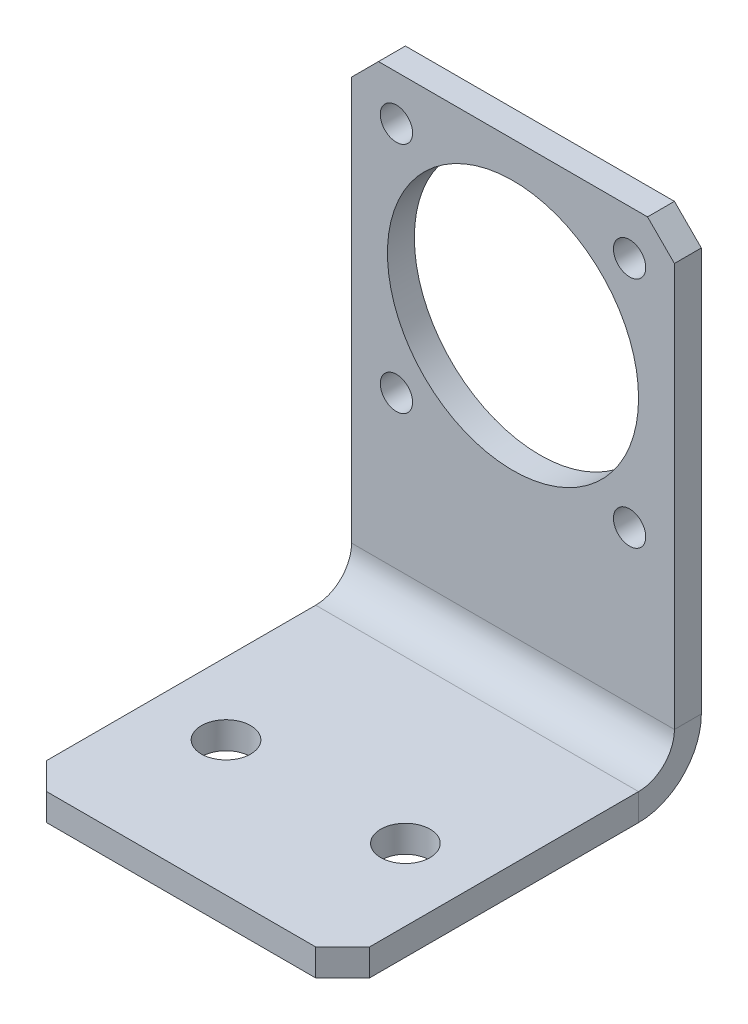
ISO-10303-21;
HEADER;
FILE_DESCRIPTION(('STEP AP214'),'2;1');
FILE_NAME('part.step','',(''),(''),'','','');
FILE_SCHEMA(('AUTOMOTIVE_DESIGN { 1 0 10303 214 1 1 1 1 }'));
ENDSEC;
DATA;
#1=APPLICATION_CONTEXT('core data for automotive mechanical design processes');
#2=APPLICATION_PROTOCOL_DEFINITION('international standard','automotive_design',2000,#1);
#3=PRODUCT_CONTEXT('',#1,'mechanical');
#4=PRODUCT('Part','Part','',(#3));
#5=PRODUCT_RELATED_PRODUCT_CATEGORY('part','',(#4));
#6=PRODUCT_DEFINITION_FORMATION('','',#4);
#7=PRODUCT_DEFINITION_CONTEXT('part definition',#1,'design');
#8=PRODUCT_DEFINITION('design','',#6,#7);
#9=PRODUCT_DEFINITION_SHAPE('','',#8);
#10=(LENGTH_UNIT() NAMED_UNIT(*) SI_UNIT(.MILLI.,.METRE.));
#11=(NAMED_UNIT(*) PLANE_ANGLE_UNIT() SI_UNIT($,.RADIAN.));
#12=(NAMED_UNIT(*) SI_UNIT($,.STERADIAN.) SOLID_ANGLE_UNIT());
#13=UNCERTAINTY_MEASURE_WITH_UNIT(LENGTH_MEASURE(1.E-05),#10,'distance_accuracy_value','');
#14=(GEOMETRIC_REPRESENTATION_CONTEXT(3) GLOBAL_UNCERTAINTY_ASSIGNED_CONTEXT((#13)) GLOBAL_UNIT_ASSIGNED_CONTEXT((#10,
#11,#12)) REPRESENTATION_CONTEXT('',''));
#15=CARTESIAN_POINT('',(0.,0.,0.));
#16=DIRECTION('',(0.,0.,1.));
#17=DIRECTION('',(1.,0.,0.));
#18=AXIS2_PLACEMENT_3D('',#15,#16,#17);
#19=CARTESIAN_POINT('',(0.,7.18062020262805,7.82));
#20=DIRECTION('',(0.,0.,-1.));
#21=DIRECTION('',(0.,1.,0.));
#22=AXIS2_PLACEMENT_3D('',#19,#20,#21);
#23=PLANE('',#22);
#24=CARTESIAN_POINT('',(13.,21.000620202628,7.81999999999997));
#25=DIRECTION('',(0.,0.,1.));
#26=DIRECTION('',(-1.,0.,0.));
#27=AXIS2_PLACEMENT_3D('',#24,#25,#26);
#28=CIRCLE('',#27,1.8);
#29=CARTESIAN_POINT('',(11.2,21.000620202628,7.81999999999997));
#30=VERTEX_POINT('',#29);
#31=EDGE_CURVE('E233',#30,#30,#28,.T.);
#32=ORIENTED_EDGE('',*,*,#31,.F.);
#33=EDGE_LOOP('',(#32));
#34=FACE_BOUND('',#33,.T.);
#35=CARTESIAN_POINT('',(-13.,21.000620202628,7.81999999999997));
#36=DIRECTION('',(0.,0.,1.));
#37=DIRECTION('',(1.,0.,0.));
#38=AXIS2_PLACEMENT_3D('',#35,#36,#37);
#39=CIRCLE('',#38,1.8);
#40=CARTESIAN_POINT('',(-11.2,21.000620202628,7.81999999999997));
#41=VERTEX_POINT('',#40);
#42=EDGE_CURVE('E229',#41,#41,#39,.T.);
#43=ORIENTED_EDGE('',*,*,#42,.F.);
#44=EDGE_LOOP('',(#43));
#45=FACE_BOUND('',#44,.T.);
#46=CARTESIAN_POINT('',(-13.,47.000620202628,7.81999999999997));
#47=DIRECTION('',(0.,0.,1.));
#48=DIRECTION('',(-1.,0.,0.));
#49=AXIS2_PLACEMENT_3D('',#46,#47,#48);
#50=CIRCLE('',#49,1.8);
#51=CARTESIAN_POINT('',(-14.8,47.000620202628,7.81999999999997));
#52=VERTEX_POINT('',#51);
#53=EDGE_CURVE('E225',#52,#52,#50,.T.);
#54=ORIENTED_EDGE('',*,*,#53,.F.);
#55=EDGE_LOOP('',(#54));
#56=FACE_BOUND('',#55,.T.);
#57=CARTESIAN_POINT('',(13.,47.000620202628,7.81999999999997));
#58=DIRECTION('',(0.,0.,1.));
#59=DIRECTION('',(1.,0.,0.));
#60=AXIS2_PLACEMENT_3D('',#57,#58,#59);
#61=CIRCLE('',#60,1.8);
#62=CARTESIAN_POINT('',(14.8,47.000620202628,7.81999999999997));
#63=VERTEX_POINT('',#62);
#64=EDGE_CURVE('E221',#63,#63,#61,.T.);
#65=ORIENTED_EDGE('',*,*,#64,.F.);
#66=EDGE_LOOP('',(#65));
#67=FACE_BOUND('',#66,.T.);
#68=CARTESIAN_POINT('',(0.,34.000620202628,7.81999999999997));
#69=DIRECTION('',(0.,0.,1.));
#70=DIRECTION('',(1.,0.,0.));
#71=AXIS2_PLACEMENT_3D('',#68,#69,#70);
#72=CIRCLE('',#71,14.);
#73=CARTESIAN_POINT('',(14.,34.000620202628,7.81999999999997));
#74=VERTEX_POINT('',#73);
#75=EDGE_CURVE('E217',#74,#74,#72,.T.);
#76=ORIENTED_EDGE('',*,*,#75,.F.);
#77=EDGE_LOOP('',(#76));
#78=FACE_BOUND('',#77,.T.);
#79=DIRECTION('',(0.,1.,0.));
#80=VECTOR('',#79,1.);
#81=CARTESIAN_POINT('',(18.,-37.6393797973719,7.81999999999984));
#82=LINE('',#81,#80);
#83=CARTESIAN_POINT('',(18.,4.00000000000002,7.81999999999999));
#84=VERTEX_POINT('',#83);
#85=CARTESIAN_POINT('',(18.,49.000620202628,7.82000000000014));
#86=VERTEX_POINT('',#85);
#87=EDGE_CURVE('E164',#84,#86,#82,.T.);
#88=ORIENTED_EDGE('',*,*,#87,.T.);
#89=DIRECTION('',(0.70710678118655,-0.707106781186545,0.));
#90=VECTOR('',#89,1.);
#91=CARTESIAN_POINT('',(18.,49.000620202628,7.82000000000014));
#92=LINE('',#91,#90);
#93=CARTESIAN_POINT('',(15.,52.000620202628,7.82000000000015));
#94=VERTEX_POINT('',#93);
#95=EDGE_CURVE('E254',#86,#94,#92,.F.);
#96=ORIENTED_EDGE('',*,*,#95,.T.);
#97=DIRECTION('',(-1.,0.,0.));
#98=VECTOR('',#97,1.);
#99=CARTESIAN_POINT('',(-18.,52.000620202628,7.82000000000015));
#100=LINE('',#99,#98);
#101=CARTESIAN_POINT('',(-15.,52.000620202628,7.82000000000015));
#102=VERTEX_POINT('',#101);
#103=EDGE_CURVE('E193',#94,#102,#100,.T.);
#104=ORIENTED_EDGE('',*,*,#103,.T.);
#105=DIRECTION('',(0.707106781186546,0.707106781186549,0.));
#106=VECTOR('',#105,1.);
#107=CARTESIAN_POINT('',(-15.,52.000620202628,7.82000000000015));
#108=LINE('',#107,#106);
#109=CARTESIAN_POINT('',(-18.,49.000620202628,7.82000000000014));
#110=VERTEX_POINT('',#109);
#111=EDGE_CURVE('E252',#102,#110,#108,.F.);
#112=ORIENTED_EDGE('',*,*,#111,.T.);
#113=DIRECTION('',(0.,-1.,0.));
#114=VECTOR('',#113,1.);
#115=CARTESIAN_POINT('',(-18.,-37.6393797973719,7.81999999999984));
#116=LINE('',#115,#114);
#117=CARTESIAN_POINT('',(-18.,4.00000000000002,7.81999999999999));
#118=VERTEX_POINT('',#117);
#119=EDGE_CURVE('E196',#110,#118,#116,.T.);
#120=ORIENTED_EDGE('',*,*,#119,.T.);
#121=DIRECTION('',(1.,0.,0.));
#122=VECTOR('',#121,1.);
#123=CARTESIAN_POINT('',(0.,4.00000000000003,7.81999999999999));
#124=LINE('',#123,#122);
#125=EDGE_CURVE('E202',#118,#84,#124,.T.);
#126=ORIENTED_EDGE('',*,*,#125,.T.);
#127=EDGE_LOOP('',(#88,#96,#104,#112,#120,#126));
#128=FACE_BOUND('',#127,.T.);
#129=ADVANCED_FACE('F41',(#34,#45,#56,#67,#78,#128),#23,.F.);
#130=CARTESIAN_POINT('',(18.,-37.6393797973719,4.81999999999984));
#131=DIRECTION('',(1.,0.,0.));
#132=DIRECTION('',(0.,1.,0.));
#133=AXIS2_PLACEMENT_3D('',#130,#131,#132);
#134=PLANE('',#133);
#135=DIRECTION('',(0.,1.,0.));
#136=VECTOR('',#135,1.);
#137=CARTESIAN_POINT('',(18.,-37.6393797973719,4.81999999999984));
#138=LINE('',#137,#136);
#139=CARTESIAN_POINT('',(18.,4.00000000000002,4.81999999999997));
#140=VERTEX_POINT('',#139);
#141=CARTESIAN_POINT('',(18.,49.000620202628,4.82000000000014));
#142=VERTEX_POINT('',#141);
#143=EDGE_CURVE('E192',#140,#142,#138,.T.);
#144=ORIENTED_EDGE('',*,*,#143,.T.);
#145=DIRECTION('',(0.,0.,1.));
#146=VECTOR('',#145,1.);
#147=CARTESIAN_POINT('',(18.,49.0006202026281,4.82000000000014));
#148=LINE('',#147,#146);
#149=EDGE_CURVE('E249',#142,#86,#148,.T.);
#150=ORIENTED_EDGE('',*,*,#149,.T.);
#151=ORIENTED_EDGE('',*,*,#87,.F.);
#152=DIRECTION('',(0.,0.,1.));
#153=VECTOR('',#152,1.);
#154=CARTESIAN_POINT('',(18.,4.00000000000004,4.81999999999998));
#155=LINE('',#154,#153);
#156=EDGE_CURVE('E199',#140,#84,#155,.T.);
#157=ORIENTED_EDGE('',*,*,#156,.F.);
#158=EDGE_LOOP('',(#144,#150,#151,#157));
#159=FACE_BOUND('',#158,.T.);
#160=ADVANCED_FACE('F269',(#159),#134,.T.);
#161=CARTESIAN_POINT('',(-18.,-37.6393797973719,4.81999999999984));
#162=DIRECTION('',(-1.,0.,0.));
#163=DIRECTION('',(0.,-1.,0.));
#164=AXIS2_PLACEMENT_3D('',#161,#162,#163);
#165=PLANE('',#164);
#166=ORIENTED_EDGE('',*,*,#119,.F.);
#167=DIRECTION('',(0.,0.,-1.));
#168=VECTOR('',#167,1.);
#169=CARTESIAN_POINT('',(-18.,49.000620202628,4.82000000000014));
#170=LINE('',#169,#168);
#171=CARTESIAN_POINT('',(-18.,49.000620202628,4.82000000000014));
#172=VERTEX_POINT('',#171);
#173=EDGE_CURVE('E12',#110,#172,#170,.T.);
#174=ORIENTED_EDGE('',*,*,#173,.T.);
#175=DIRECTION('',(0.,-1.,0.));
#176=VECTOR('',#175,1.);
#177=CARTESIAN_POINT('',(-18.,-37.6393797973719,4.81999999999984));
#178=LINE('',#177,#176);
#179=CARTESIAN_POINT('',(-18.,4.00000000000002,4.81999999999999));
#180=VERTEX_POINT('',#179);
#181=EDGE_CURVE('E191',#172,#180,#178,.T.);
#182=ORIENTED_EDGE('',*,*,#181,.T.);
#183=DIRECTION('',(0.,0.,-1.));
#184=VECTOR('',#183,1.);
#185=CARTESIAN_POINT('',(-18.,4.00000000000004,4.81999999999998));
#186=LINE('',#185,#184);
#187=EDGE_CURVE('E138',#118,#180,#186,.T.);
#188=ORIENTED_EDGE('',*,*,#187,.F.);
#189=EDGE_LOOP('',(#166,#174,#182,#188));
#190=FACE_BOUND('',#189,.T.);
#191=ADVANCED_FACE('F277',(#190),#165,.T.);
#192=CARTESIAN_POINT('',(-18.,52.0006202026281,4.82000000000015));
#193=DIRECTION('',(0.,1.,0.));
#194=DIRECTION('',(-1.,0.,0.));
#195=AXIS2_PLACEMENT_3D('',#192,#193,#194);
#196=PLANE('',#195);
#197=ORIENTED_EDGE('',*,*,#103,.F.);
#198=DIRECTION('',(0.,0.,-1.));
#199=VECTOR('',#198,1.);
#200=CARTESIAN_POINT('',(15.,52.0006202026281,4.82000000000015));
#201=LINE('',#200,#199);
#202=CARTESIAN_POINT('',(15.,52.0006202026281,4.82000000000015));
#203=VERTEX_POINT('',#202);
#204=EDGE_CURVE('E259',#94,#203,#201,.T.);
#205=ORIENTED_EDGE('',*,*,#204,.T.);
#206=DIRECTION('',(-1.,0.,0.));
#207=VECTOR('',#206,1.);
#208=CARTESIAN_POINT('',(-18.,52.0006202026281,4.82000000000015));
#209=LINE('',#208,#207);
#210=CARTESIAN_POINT('',(-15.,52.0006202026281,4.82000000000015));
#211=VERTEX_POINT('',#210);
#212=EDGE_CURVE('E189',#203,#211,#209,.T.);
#213=ORIENTED_EDGE('',*,*,#212,.T.);
#214=DIRECTION('',(0.,0.,1.));
#215=VECTOR('',#214,1.);
#216=CARTESIAN_POINT('',(-15.,52.0006202026281,4.82000000000015));
#217=LINE('',#216,#215);
#218=EDGE_CURVE('E256',#211,#102,#217,.T.);
#219=ORIENTED_EDGE('',*,*,#218,.T.);
#220=EDGE_LOOP('',(#197,#205,#213,#219));
#221=FACE_BOUND('',#220,.T.);
#222=ADVANCED_FACE('F274',(#221),#196,.T.);
#223=CARTESIAN_POINT('',(0.,7.18062020262806,4.82));
#224=DIRECTION('',(0.,0.,-1.));
#225=DIRECTION('',(0.,1.,0.));
#226=AXIS2_PLACEMENT_3D('',#223,#224,#225);
#227=PLANE('',#226);
#228=CARTESIAN_POINT('',(13.,21.000620202628,4.82000000000005));
#229=DIRECTION('',(0.,0.,-1.));
#230=DIRECTION('',(0.,1.,0.));
#231=AXIS2_PLACEMENT_3D('',#228,#229,#230);
#232=CIRCLE('',#231,1.8);
#233=CARTESIAN_POINT('',(13.,22.800620202628,4.82000000000005));
#234=VERTEX_POINT('',#233);
#235=EDGE_CURVE('E230',#234,#234,#232,.T.);
#236=ORIENTED_EDGE('',*,*,#235,.F.);
#237=EDGE_LOOP('',(#236));
#238=FACE_BOUND('',#237,.T.);
#239=CARTESIAN_POINT('',(-13.,21.000620202628,4.82000000000005));
#240=DIRECTION('',(0.,0.,-1.));
#241=DIRECTION('',(0.,1.,0.));
#242=AXIS2_PLACEMENT_3D('',#239,#240,#241);
#243=CIRCLE('',#242,1.8);
#244=CARTESIAN_POINT('',(-13.,22.800620202628,4.82000000000005));
#245=VERTEX_POINT('',#244);
#246=EDGE_CURVE('E226',#245,#245,#243,.T.);
#247=ORIENTED_EDGE('',*,*,#246,.F.);
#248=EDGE_LOOP('',(#247));
#249=FACE_BOUND('',#248,.T.);
#250=CARTESIAN_POINT('',(-13.,47.000620202628,4.82000000000014));
#251=DIRECTION('',(0.,0.,-1.));
#252=DIRECTION('',(0.,1.,0.));
#253=AXIS2_PLACEMENT_3D('',#250,#251,#252);
#254=CIRCLE('',#253,1.8);
#255=CARTESIAN_POINT('',(-13.,48.800620202628,4.82000000000014));
#256=VERTEX_POINT('',#255);
#257=EDGE_CURVE('E222',#256,#256,#254,.T.);
#258=ORIENTED_EDGE('',*,*,#257,.F.);
#259=EDGE_LOOP('',(#258));
#260=FACE_BOUND('',#259,.T.);
#261=CARTESIAN_POINT('',(13.,47.000620202628,4.82000000000014));
#262=DIRECTION('',(0.,0.,-1.));
#263=DIRECTION('',(0.,1.,0.));
#264=AXIS2_PLACEMENT_3D('',#261,#262,#263);
#265=CIRCLE('',#264,1.8);
#266=CARTESIAN_POINT('',(13.,48.800620202628,4.82000000000014));
#267=VERTEX_POINT('',#266);
#268=EDGE_CURVE('E218',#267,#267,#265,.T.);
#269=ORIENTED_EDGE('',*,*,#268,.F.);
#270=EDGE_LOOP('',(#269));
#271=FACE_BOUND('',#270,.T.);
#272=CARTESIAN_POINT('',(0.,34.000620202628,4.82000000000009));
#273=DIRECTION('',(0.,0.,-1.));
#274=DIRECTION('',(0.,1.,0.));
#275=AXIS2_PLACEMENT_3D('',#272,#273,#274);
#276=CIRCLE('',#275,14.);
#277=CARTESIAN_POINT('',(0.,48.000620202628,4.82000000000014));
#278=VERTEX_POINT('',#277);
#279=EDGE_CURVE('E213',#278,#278,#276,.T.);
#280=ORIENTED_EDGE('',*,*,#279,.F.);
#281=EDGE_LOOP('',(#280));
#282=FACE_BOUND('',#281,.T.);
#283=ORIENTED_EDGE('',*,*,#212,.F.);
#284=DIRECTION('',(-0.70710678118655,0.707106781186545,0.));
#285=VECTOR('',#284,1.);
#286=CARTESIAN_POINT('',(29.9099999999999,37.0906202026282,4.8200000000001));
#287=LINE('',#286,#285);
#288=EDGE_CURVE('E49',#203,#142,#287,.F.);
#289=ORIENTED_EDGE('',*,*,#288,.T.);
#290=ORIENTED_EDGE('',*,*,#143,.F.);
#291=DIRECTION('',(1.,0.,0.));
#292=VECTOR('',#291,1.);
#293=CARTESIAN_POINT('',(0.,4.00000000000004,4.81999999999999));
#294=LINE('',#293,#292);
#295=EDGE_CURVE('E197',#180,#140,#294,.T.);
#296=ORIENTED_EDGE('',*,*,#295,.F.);
#297=ORIENTED_EDGE('',*,*,#181,.F.);
#298=DIRECTION('',(-0.707106781186546,-0.707106781186549,0.));
#299=VECTOR('',#298,1.);
#300=CARTESIAN_POINT('',(-29.91,37.090620202628,4.8200000000001));
#301=LINE('',#300,#299);
#302=EDGE_CURVE('E61',#172,#211,#301,.F.);
#303=ORIENTED_EDGE('',*,*,#302,.T.);
#304=EDGE_LOOP('',(#283,#289,#290,#296,#297,#303));
#305=FACE_BOUND('',#304,.T.);
#306=ADVANCED_FACE('F263',(#238,#249,#260,#271,#282,#305),#227,.T.);
#307=CARTESIAN_POINT('',(-18.,-3.,44.82));
#308=DIRECTION('',(0.,0.,1.));
#309=DIRECTION('',(1.,0.,0.));
#310=AXIS2_PLACEMENT_3D('',#307,#308,#309);
#311=PLANE('',#310);
#312=DIRECTION('',(1.,0.,0.));
#313=VECTOR('',#312,1.);
#314=CARTESIAN_POINT('',(-18.,0.,44.82));
#315=LINE('',#314,#313);
#316=CARTESIAN_POINT('',(-15.,0.,44.82));
#317=VERTEX_POINT('',#316);
#318=CARTESIAN_POINT('',(15.,0.,44.82));
#319=VERTEX_POINT('',#318);
#320=EDGE_CURVE('E173',#317,#319,#315,.T.);
#321=ORIENTED_EDGE('',*,*,#320,.F.);
#322=DIRECTION('',(0.,-1.,0.));
#323=VECTOR('',#322,1.);
#324=CARTESIAN_POINT('',(-15.,-3.,44.82));
#325=LINE('',#324,#323);
#326=CARTESIAN_POINT('',(-15.,-3.,44.82));
#327=VERTEX_POINT('',#326);
#328=EDGE_CURVE('E242',#317,#327,#325,.T.);
#329=ORIENTED_EDGE('',*,*,#328,.T.);
#330=DIRECTION('',(1.,0.,0.));
#331=VECTOR('',#330,1.);
#332=CARTESIAN_POINT('',(-18.,-3.,44.82));
#333=LINE('',#332,#331);
#334=CARTESIAN_POINT('',(15.,-3.,44.82));
#335=VERTEX_POINT('',#334);
#336=EDGE_CURVE('E153',#327,#335,#333,.T.);
#337=ORIENTED_EDGE('',*,*,#336,.T.);
#338=DIRECTION('',(0.,1.,0.));
#339=VECTOR('',#338,1.);
#340=CARTESIAN_POINT('',(15.,-3.,44.82));
#341=LINE('',#340,#339);
#342=EDGE_CURVE('E239',#335,#319,#341,.T.);
#343=ORIENTED_EDGE('',*,*,#342,.T.);
#344=EDGE_LOOP('',(#321,#329,#337,#343));
#345=FACE_BOUND('',#344,.T.);
#346=ADVANCED_FACE('F330',(#345),#311,.T.);
#347=CARTESIAN_POINT('',(0.,-3.,0.));
#348=DIRECTION('',(0.,-1.,0.));
#349=DIRECTION('',(0.,0.,-1.));
#350=AXIS2_PLACEMENT_3D('',#347,#348,#349);
#351=PLANE('',#350);
#352=CARTESIAN_POINT('',(10.,-3.,29.82));
#353=DIRECTION('',(0.,-1.,0.));
#354=DIRECTION('',(0.,0.,-1.));
#355=AXIS2_PLACEMENT_3D('',#352,#353,#354);
#356=CIRCLE('',#355,2.75);
#357=CARTESIAN_POINT('',(10.,-3.,27.07));
#358=VERTEX_POINT('',#357);
#359=EDGE_CURVE('E302',#358,#358,#356,.T.);
#360=ORIENTED_EDGE('',*,*,#359,.F.);
#361=EDGE_LOOP('',(#360));
#362=FACE_BOUND('',#361,.T.);
#363=CARTESIAN_POINT('',(-10.,-3.,29.82));
#364=DIRECTION('',(0.,-1.,0.));
#365=DIRECTION('',(0.,0.,-1.));
#366=AXIS2_PLACEMENT_3D('',#363,#364,#365);
#367=CIRCLE('',#366,2.75);
#368=CARTESIAN_POINT('',(-10.,-3.,27.07));
#369=VERTEX_POINT('',#368);
#370=EDGE_CURVE('E296',#369,#369,#367,.T.);
#371=ORIENTED_EDGE('',*,*,#370,.F.);
#372=EDGE_LOOP('',(#371));
#373=FACE_BOUND('',#372,.T.);
#374=ORIENTED_EDGE('',*,*,#336,.F.);
#375=DIRECTION('',(0.70710678118655,0.,0.707106781186545));
#376=VECTOR('',#375,1.);
#377=CARTESIAN_POINT('',(-29.9099999999999,-3.,29.9100000000001));
#378=LINE('',#377,#376);
#379=CARTESIAN_POINT('',(-18.,-3.,41.82));
#380=VERTEX_POINT('',#379);
#381=EDGE_CURVE('E160',#327,#380,#378,.F.);
#382=ORIENTED_EDGE('',*,*,#381,.T.);
#383=DIRECTION('',(0.,0.,1.));
#384=VECTOR('',#383,1.);
#385=CARTESIAN_POINT('',(-18.,-3.,44.82));
#386=LINE('',#385,#384);
#387=CARTESIAN_POINT('',(-18.,-3.,11.82));
#388=VERTEX_POINT('',#387);
#389=EDGE_CURVE('E156',#388,#380,#386,.T.);
#390=ORIENTED_EDGE('',*,*,#389,.F.);
#391=DIRECTION('',(1.,0.,0.));
#392=VECTOR('',#391,1.);
#393=CARTESIAN_POINT('',(0.,-3.,11.82));
#394=LINE('',#393,#392);
#395=CARTESIAN_POINT('',(18.,-3.,11.82));
#396=VERTEX_POINT('',#395);
#397=EDGE_CURVE('E146',#388,#396,#394,.T.);
#398=ORIENTED_EDGE('',*,*,#397,.T.);
#399=DIRECTION('',(0.,0.,-1.));
#400=VECTOR('',#399,1.);
#401=CARTESIAN_POINT('',(18.,-3.,44.82));
#402=LINE('',#401,#400);
#403=CARTESIAN_POINT('',(18.,-3.,41.82));
#404=VERTEX_POINT('',#403);
#405=EDGE_CURVE('E152',#404,#396,#402,.T.);
#406=ORIENTED_EDGE('',*,*,#405,.F.);
#407=DIRECTION('',(0.707106781186546,0.,-0.707106781186549));
#408=VECTOR('',#407,1.);
#409=CARTESIAN_POINT('',(29.91,-3.,29.9099999999999));
#410=LINE('',#409,#408);
#411=EDGE_CURVE('E244',#404,#335,#410,.F.);
#412=ORIENTED_EDGE('',*,*,#411,.T.);
#413=EDGE_LOOP('',(#374,#382,#390,#398,#406,#412));
#414=FACE_BOUND('',#413,.T.);
#415=ADVANCED_FACE('F158',(#362,#373,#414),#351,.T.);
#416=CARTESIAN_POINT('',(18.,-3.,44.82));
#417=DIRECTION('',(1.,0.,0.));
#418=DIRECTION('',(0.,0.,-1.));
#419=AXIS2_PLACEMENT_3D('',#416,#417,#418);
#420=PLANE('',#419);
#421=DIRECTION('',(0.,0.,-1.));
#422=VECTOR('',#421,1.);
#423=CARTESIAN_POINT('',(18.,0.,44.82));
#424=LINE('',#423,#422);
#425=CARTESIAN_POINT('',(18.,0.,41.82));
#426=VERTEX_POINT('',#425);
#427=CARTESIAN_POINT('',(18.,0.,11.82));
#428=VERTEX_POINT('',#427);
#429=EDGE_CURVE('E171',#426,#428,#424,.T.);
#430=ORIENTED_EDGE('',*,*,#429,.F.);
#431=DIRECTION('',(0.,-1.,0.));
#432=VECTOR('',#431,1.);
#433=CARTESIAN_POINT('',(18.,-3.,41.82));
#434=LINE('',#433,#432);
#435=EDGE_CURVE('E247',#426,#404,#434,.T.);
#436=ORIENTED_EDGE('',*,*,#435,.T.);
#437=ORIENTED_EDGE('',*,*,#405,.T.);
#438=DIRECTION('',(0.,1.,0.));
#439=VECTOR('',#438,1.);
#440=CARTESIAN_POINT('',(18.,-3.,11.82));
#441=LINE('',#440,#439);
#442=EDGE_CURVE('E180',#396,#428,#441,.T.);
#443=ORIENTED_EDGE('',*,*,#442,.T.);
#444=EDGE_LOOP('',(#430,#436,#437,#443));
#445=FACE_BOUND('',#444,.T.);
#446=ADVANCED_FACE('F314',(#445),#420,.T.);
#447=CARTESIAN_POINT('',(0.,0.,0.));
#448=DIRECTION('',(0.,-1.,0.));
#449=DIRECTION('',(0.,0.,-1.));
#450=AXIS2_PLACEMENT_3D('',#447,#448,#449);
#451=PLANE('',#450);
#452=CARTESIAN_POINT('',(10.,0.,29.82));
#453=DIRECTION('',(0.,1.,0.));
#454=DIRECTION('',(0.,0.,-1.));
#455=AXIS2_PLACEMENT_3D('',#452,#453,#454);
#456=CIRCLE('',#455,2.75);
#457=CARTESIAN_POINT('',(10.,0.,27.07));
#458=VERTEX_POINT('',#457);
#459=EDGE_CURVE('E305',#458,#458,#456,.T.);
#460=ORIENTED_EDGE('',*,*,#459,.F.);
#461=EDGE_LOOP('',(#460));
#462=FACE_BOUND('',#461,.T.);
#463=CARTESIAN_POINT('',(-10.,0.,29.82));
#464=DIRECTION('',(0.,1.,0.));
#465=DIRECTION('',(0.,0.,1.));
#466=AXIS2_PLACEMENT_3D('',#463,#464,#465);
#467=CIRCLE('',#466,2.75);
#468=CARTESIAN_POINT('',(-10.,0.,32.57));
#469=VERTEX_POINT('',#468);
#470=EDGE_CURVE('E299',#469,#469,#467,.T.);
#471=ORIENTED_EDGE('',*,*,#470,.F.);
#472=EDGE_LOOP('',(#471));
#473=FACE_BOUND('',#472,.T.);
#474=DIRECTION('',(0.,0.,1.));
#475=VECTOR('',#474,1.);
#476=CARTESIAN_POINT('',(-18.,0.,44.82));
#477=LINE('',#476,#475);
#478=CARTESIAN_POINT('',(-18.,0.,11.82));
#479=VERTEX_POINT('',#478);
#480=CARTESIAN_POINT('',(-18.,0.,41.82));
#481=VERTEX_POINT('',#480);
#482=EDGE_CURVE('E169',#479,#481,#477,.T.);
#483=ORIENTED_EDGE('',*,*,#482,.T.);
#484=DIRECTION('',(-0.70710678118655,0.,-0.707106781186545));
#485=VECTOR('',#484,1.);
#486=CARTESIAN_POINT('',(-18.,0.,41.82));
#487=LINE('',#486,#485);
#488=EDGE_CURVE('E237',#481,#317,#487,.F.);
#489=ORIENTED_EDGE('',*,*,#488,.T.);
#490=ORIENTED_EDGE('',*,*,#320,.T.);
#491=DIRECTION('',(-0.707106781186546,0.,0.707106781186549));
#492=VECTOR('',#491,1.);
#493=CARTESIAN_POINT('',(15.,0.,44.82));
#494=LINE('',#493,#492);
#495=EDGE_CURVE('E235',#319,#426,#494,.F.);
#496=ORIENTED_EDGE('',*,*,#495,.T.);
#497=ORIENTED_EDGE('',*,*,#429,.T.);
#498=DIRECTION('',(1.,0.,0.));
#499=VECTOR('',#498,1.);
#500=CARTESIAN_POINT('',(0.,0.,11.82));
#501=LINE('',#500,#499);
#502=EDGE_CURVE('E186',#479,#428,#501,.T.);
#503=ORIENTED_EDGE('',*,*,#502,.F.);
#504=EDGE_LOOP('',(#483,#489,#490,#496,#497,#503));
#505=FACE_BOUND('',#504,.T.);
#506=ADVANCED_FACE('F311',(#462,#473,#505),#451,.F.);
#507=CARTESIAN_POINT('',(-18.,-3.,44.82));
#508=DIRECTION('',(-1.,0.,0.));
#509=DIRECTION('',(0.,0.,1.));
#510=AXIS2_PLACEMENT_3D('',#507,#508,#509);
#511=PLANE('',#510);
#512=ORIENTED_EDGE('',*,*,#389,.T.);
#513=DIRECTION('',(0.,1.,0.));
#514=VECTOR('',#513,1.);
#515=CARTESIAN_POINT('',(-18.,-3.,41.82));
#516=LINE('',#515,#514);
#517=EDGE_CURVE('E206',#380,#481,#516,.T.);
#518=ORIENTED_EDGE('',*,*,#517,.T.);
#519=ORIENTED_EDGE('',*,*,#482,.F.);
#520=DIRECTION('',(0.,-1.,0.));
#521=VECTOR('',#520,1.);
#522=CARTESIAN_POINT('',(-18.,-3.,11.82));
#523=LINE('',#522,#521);
#524=EDGE_CURVE('E135',#479,#388,#523,.T.);
#525=ORIENTED_EDGE('',*,*,#524,.T.);
#526=EDGE_LOOP('',(#512,#518,#519,#525));
#527=FACE_BOUND('',#526,.T.);
#528=ADVANCED_FACE('F167',(#527),#511,.T.);
#529=CARTESIAN_POINT('',(-18.,4.,11.82));
#530=DIRECTION('',(-1.,0.,0.));
#531=DIRECTION('',(0.,0.,1.));
#532=AXIS2_PLACEMENT_3D('',#529,#530,#531);
#533=PLANE('',#532);
#534=ORIENTED_EDGE('',*,*,#524,.F.);
#535=CARTESIAN_POINT('',(-18.,4.,11.82));
#536=DIRECTION('',(1.,0.,0.));
#537=DIRECTION('',(0.,0.,-1.));
#538=AXIS2_PLACEMENT_3D('',#535,#536,#537);
#539=CIRCLE('',#538,4.);
#540=EDGE_CURVE('E216',#479,#118,#539,.T.);
#541=ORIENTED_EDGE('',*,*,#540,.T.);
#542=ORIENTED_EDGE('',*,*,#187,.T.);
#543=CARTESIAN_POINT('',(-18.,4.,11.82));
#544=DIRECTION('',(1.,0.,0.));
#545=DIRECTION('',(0.,0.,1.));
#546=AXIS2_PLACEMENT_3D('',#543,#544,#545);
#547=CIRCLE('',#546,7.);
#548=EDGE_CURVE('E130',#388,#180,#547,.T.);
#549=ORIENTED_EDGE('',*,*,#548,.F.);
#550=EDGE_LOOP('',(#534,#541,#542,#549));
#551=FACE_BOUND('',#550,.T.);
#552=ADVANCED_FACE('F132',(#551),#533,.T.);
#553=CARTESIAN_POINT('',(18.,4.,11.82));
#554=DIRECTION('',(1.,0.,0.));
#555=DIRECTION('',(0.,0.,-1.));
#556=AXIS2_PLACEMENT_3D('',#553,#554,#555);
#557=PLANE('',#556);
#558=ORIENTED_EDGE('',*,*,#156,.T.);
#559=CARTESIAN_POINT('',(18.,4.,11.82));
#560=DIRECTION('',(1.,0.,0.));
#561=DIRECTION('',(0.,0.,-1.));
#562=AXIS2_PLACEMENT_3D('',#559,#560,#561);
#563=CIRCLE('',#562,4.);
#564=EDGE_CURVE('E142',#84,#428,#563,.F.);
#565=ORIENTED_EDGE('',*,*,#564,.T.);
#566=ORIENTED_EDGE('',*,*,#442,.F.);
#567=CARTESIAN_POINT('',(18.,4.,11.82));
#568=DIRECTION('',(-1.,0.,0.));
#569=DIRECTION('',(0.,0.,-1.));
#570=AXIS2_PLACEMENT_3D('',#567,#568,#569);
#571=CIRCLE('',#570,7.);
#572=EDGE_CURVE('E141',#140,#396,#571,.T.);
#573=ORIENTED_EDGE('',*,*,#572,.F.);
#574=EDGE_LOOP('',(#558,#565,#566,#573));
#575=FACE_BOUND('',#574,.T.);
#576=ADVANCED_FACE('F322',(#575),#557,.T.);
#577=CARTESIAN_POINT('',(-37.1434904563806,4.,11.82));
#578=DIRECTION('',(1.,0.,0.));
#579=DIRECTION('',(0.,0.,-1.));
#580=AXIS2_PLACEMENT_3D('',#577,#578,#579);
#581=CYLINDRICAL_SURFACE('',#580,7.);
#582=ORIENTED_EDGE('',*,*,#572,.T.);
#583=ORIENTED_EDGE('',*,*,#397,.F.);
#584=ORIENTED_EDGE('',*,*,#548,.T.);
#585=ORIENTED_EDGE('',*,*,#295,.T.);
#586=EDGE_LOOP('',(#582,#583,#584,#585));
#587=FACE_BOUND('',#586,.T.);
#588=ADVANCED_FACE('F148',(#587),#581,.T.);
#589=CARTESIAN_POINT('',(-37.1434904563806,4.,11.82));
#590=DIRECTION('',(1.,0.,0.));
#591=DIRECTION('',(0.,0.,-1.));
#592=AXIS2_PLACEMENT_3D('',#589,#590,#591);
#593=CYLINDRICAL_SURFACE('',#592,4.);
#594=ORIENTED_EDGE('',*,*,#564,.F.);
#595=ORIENTED_EDGE('',*,*,#125,.F.);
#596=ORIENTED_EDGE('',*,*,#540,.F.);
#597=ORIENTED_EDGE('',*,*,#502,.T.);
#598=EDGE_LOOP('',(#594,#595,#596,#597));
#599=FACE_BOUND('',#598,.T.);
#600=ADVANCED_FACE('F281',(#599),#593,.F.);
#601=CARTESIAN_POINT('',(0.,34.000620202628,-2.18000000000003));
#602=DIRECTION('',(0.,0.,1.));
#603=DIRECTION('',(1.,0.,0.));
#604=AXIS2_PLACEMENT_3D('',#601,#602,#603);
#605=CYLINDRICAL_SURFACE('',#604,14.);
#606=ORIENTED_EDGE('',*,*,#279,.T.);
#607=EDGE_LOOP('',(#606));
#608=FACE_BOUND('',#607,.T.);
#609=ORIENTED_EDGE('',*,*,#75,.T.);
#610=EDGE_LOOP('',(#609));
#611=FACE_BOUND('',#610,.T.);
#612=ADVANCED_FACE('F381',(#608,#611),#605,.F.);
#613=CARTESIAN_POINT('',(13.,47.000620202628,-2.18000000000003));
#614=DIRECTION('',(0.,0.,1.));
#615=DIRECTION('',(1.,0.,0.));
#616=AXIS2_PLACEMENT_3D('',#613,#614,#615);
#617=CYLINDRICAL_SURFACE('',#616,1.8);
#618=ORIENTED_EDGE('',*,*,#268,.T.);
#619=EDGE_LOOP('',(#618));
#620=FACE_BOUND('',#619,.T.);
#621=ORIENTED_EDGE('',*,*,#64,.T.);
#622=EDGE_LOOP('',(#621));
#623=FACE_BOUND('',#622,.T.);
#624=ADVANCED_FACE('F386',(#620,#623),#617,.F.);
#625=CARTESIAN_POINT('',(-13.,47.000620202628,-2.18000000000003));
#626=DIRECTION('',(0.,0.,1.));
#627=DIRECTION('',(1.,0.,0.));
#628=AXIS2_PLACEMENT_3D('',#625,#626,#627);
#629=CYLINDRICAL_SURFACE('',#628,1.8);
#630=ORIENTED_EDGE('',*,*,#257,.T.);
#631=EDGE_LOOP('',(#630));
#632=FACE_BOUND('',#631,.T.);
#633=ORIENTED_EDGE('',*,*,#53,.T.);
#634=EDGE_LOOP('',(#633));
#635=FACE_BOUND('',#634,.T.);
#636=ADVANCED_FACE('F390',(#632,#635),#629,.F.);
#637=CARTESIAN_POINT('',(-13.,21.000620202628,-2.18000000000003));
#638=DIRECTION('',(0.,0.,1.));
#639=DIRECTION('',(1.,0.,0.));
#640=AXIS2_PLACEMENT_3D('',#637,#638,#639);
#641=CYLINDRICAL_SURFACE('',#640,1.8);
#642=ORIENTED_EDGE('',*,*,#246,.T.);
#643=EDGE_LOOP('',(#642));
#644=FACE_BOUND('',#643,.T.);
#645=ORIENTED_EDGE('',*,*,#42,.T.);
#646=EDGE_LOOP('',(#645));
#647=FACE_BOUND('',#646,.T.);
#648=ADVANCED_FACE('F342',(#644,#647),#641,.F.);
#649=CARTESIAN_POINT('',(13.,21.000620202628,-2.18000000000003));
#650=DIRECTION('',(0.,0.,1.));
#651=DIRECTION('',(1.,0.,0.));
#652=AXIS2_PLACEMENT_3D('',#649,#650,#651);
#653=CYLINDRICAL_SURFACE('',#652,1.8);
#654=ORIENTED_EDGE('',*,*,#235,.T.);
#655=EDGE_LOOP('',(#654));
#656=FACE_BOUND('',#655,.T.);
#657=ORIENTED_EDGE('',*,*,#31,.T.);
#658=EDGE_LOOP('',(#657));
#659=FACE_BOUND('',#658,.T.);
#660=ADVANCED_FACE('F335',(#656,#659),#653,.F.);
#661=CARTESIAN_POINT('',(-18.,-3.,41.82));
#662=DIRECTION('',(0.707106781186545,0.,-0.70710678118655));
#663=DIRECTION('',(0.,1.,0.));
#664=AXIS2_PLACEMENT_3D('',#661,#662,#663);
#665=PLANE('',#664);
#666=ORIENTED_EDGE('',*,*,#381,.F.);
#667=ORIENTED_EDGE('',*,*,#328,.F.);
#668=ORIENTED_EDGE('',*,*,#488,.F.);
#669=ORIENTED_EDGE('',*,*,#517,.F.);
#670=EDGE_LOOP('',(#666,#667,#668,#669));
#671=FACE_BOUND('',#670,.T.);
#672=ADVANCED_FACE('F333',(#671),#665,.F.);
#673=CARTESIAN_POINT('',(15.,-3.,44.82));
#674=DIRECTION('',(-0.707106781186549,0.,-0.707106781186546));
#675=DIRECTION('',(0.,1.,0.));
#676=AXIS2_PLACEMENT_3D('',#673,#674,#675);
#677=PLANE('',#676);
#678=ORIENTED_EDGE('',*,*,#411,.F.);
#679=ORIENTED_EDGE('',*,*,#435,.F.);
#680=ORIENTED_EDGE('',*,*,#495,.F.);
#681=ORIENTED_EDGE('',*,*,#342,.F.);
#682=EDGE_LOOP('',(#678,#679,#680,#681));
#683=FACE_BOUND('',#682,.T.);
#684=ADVANCED_FACE('F328',(#683),#677,.F.);
#685=CARTESIAN_POINT('',(18.,49.0006202026281,4.82000000000014));
#686=DIRECTION('',(-0.707106781186545,-0.70710678118655,0.));
#687=DIRECTION('',(0.,0.,1.));
#688=AXIS2_PLACEMENT_3D('',#685,#686,#687);
#689=PLANE('',#688);
#690=ORIENTED_EDGE('',*,*,#288,.F.);
#691=ORIENTED_EDGE('',*,*,#204,.F.);
#692=ORIENTED_EDGE('',*,*,#95,.F.);
#693=ORIENTED_EDGE('',*,*,#149,.F.);
#694=EDGE_LOOP('',(#690,#691,#692,#693));
#695=FACE_BOUND('',#694,.T.);
#696=ADVANCED_FACE('F270',(#695),#689,.F.);
#697=CARTESIAN_POINT('',(-15.,52.0006202026281,4.82000000000015));
#698=DIRECTION('',(0.707106781186549,-0.707106781186546,0.));
#699=DIRECTION('',(0.,0.,1.));
#700=AXIS2_PLACEMENT_3D('',#697,#698,#699);
#701=PLANE('',#700);
#702=ORIENTED_EDGE('',*,*,#302,.F.);
#703=ORIENTED_EDGE('',*,*,#173,.F.);
#704=ORIENTED_EDGE('',*,*,#111,.F.);
#705=ORIENTED_EDGE('',*,*,#218,.F.);
#706=EDGE_LOOP('',(#702,#703,#704,#705));
#707=FACE_BOUND('',#706,.T.);
#708=ADVANCED_FACE('F43',(#707),#701,.F.);
#709=CARTESIAN_POINT('',(-10.,-10.,29.82));
#710=DIRECTION('',(0.,1.,0.));
#711=DIRECTION('',(0.,0.,1.));
#712=AXIS2_PLACEMENT_3D('',#709,#710,#711);
#713=CYLINDRICAL_SURFACE('',#712,2.75);
#714=ORIENTED_EDGE('',*,*,#370,.T.);
#715=EDGE_LOOP('',(#714));
#716=FACE_BOUND('',#715,.T.);
#717=ORIENTED_EDGE('',*,*,#470,.T.);
#718=EDGE_LOOP('',(#717));
#719=FACE_BOUND('',#718,.T.);
#720=ADVANCED_FACE('F398',(#716,#719),#713,.F.);
#721=CARTESIAN_POINT('',(10.,-10.,29.82));
#722=DIRECTION('',(0.,1.,0.));
#723=DIRECTION('',(0.,0.,1.));
#724=AXIS2_PLACEMENT_3D('',#721,#722,#723);
#725=CYLINDRICAL_SURFACE('',#724,2.75);
#726=ORIENTED_EDGE('',*,*,#359,.T.);
#727=EDGE_LOOP('',(#726));
#728=FACE_BOUND('',#727,.T.);
#729=ORIENTED_EDGE('',*,*,#459,.T.);
#730=EDGE_LOOP('',(#729));
#731=FACE_BOUND('',#730,.T.);
#732=ADVANCED_FACE('F309',(#728,#731),#725,.F.);
#733=CLOSED_SHELL('',(#129,#160,#191,#222,#306,#346,#415,#446,#506,#528,#552,#576,#588,#600,
#612,#624,#636,#648,#660,#672,#684,#696,#708,#720,#732));
#734=MANIFOLD_SOLID_BREP('B2',#733);
#735=ADVANCED_BREP_SHAPE_REPRESENTATION('',(#18,#734),#14);
#736=SHAPE_DEFINITION_REPRESENTATION(#9,#735);
ENDSEC;
END-ISO-10303-21;
